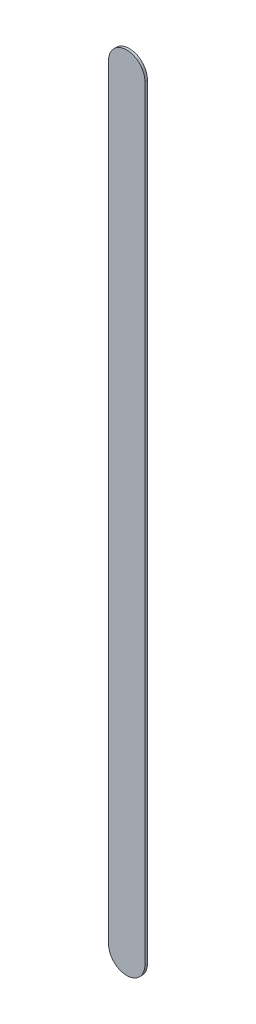
ISO-10303-21;
HEADER;
FILE_DESCRIPTION(('STEP AP214'),'2;1');
FILE_NAME('part.step','',(''),(''),'','','');
FILE_SCHEMA(('AUTOMOTIVE_DESIGN { 1 0 10303 214 1 1 1 1 }'));
ENDSEC;
DATA;
#1=APPLICATION_CONTEXT('core data for automotive mechanical design processes');
#2=APPLICATION_PROTOCOL_DEFINITION('international standard','automotive_design',2000,#1);
#3=PRODUCT_CONTEXT('',#1,'mechanical');
#4=PRODUCT('Part','Part','',(#3));
#5=PRODUCT_RELATED_PRODUCT_CATEGORY('part','',(#4));
#6=PRODUCT_DEFINITION_FORMATION('','',#4);
#7=PRODUCT_DEFINITION_CONTEXT('part definition',#1,'design');
#8=PRODUCT_DEFINITION('design','',#6,#7);
#9=PRODUCT_DEFINITION_SHAPE('','',#8);
#10=(LENGTH_UNIT() NAMED_UNIT(*) SI_UNIT(.MILLI.,.METRE.));
#11=(NAMED_UNIT(*) PLANE_ANGLE_UNIT() SI_UNIT($,.RADIAN.));
#12=(NAMED_UNIT(*) SI_UNIT($,.STERADIAN.) SOLID_ANGLE_UNIT());
#13=UNCERTAINTY_MEASURE_WITH_UNIT(LENGTH_MEASURE(1.E-05),#10,'distance_accuracy_value','');
#14=(GEOMETRIC_REPRESENTATION_CONTEXT(3) GLOBAL_UNCERTAINTY_ASSIGNED_CONTEXT((#13)) GLOBAL_UNIT_ASSIGNED_CONTEXT((#10,
#11,#12)) REPRESENTATION_CONTEXT('',''));
#15=CARTESIAN_POINT('',(0.,0.,0.));
#16=DIRECTION('',(0.,0.,1.));
#17=DIRECTION('',(1.,0.,0.));
#18=AXIS2_PLACEMENT_3D('',#15,#16,#17);
#19=CARTESIAN_POINT('',(119.376,-111.252,0.));
#20=DIRECTION('',(0.,0.,1.));
#21=DIRECTION('',(1.,0.,0.));
#22=AXIS2_PLACEMENT_3D('',#19,#20,#21);
#23=PLANE('',#22);
#24=DIRECTION('',(0.,1.,0.));
#25=VECTOR('',#24,1.);
#26=CARTESIAN_POINT('',(119.376,-111.252,0.));
#27=LINE('',#26,#25);
#28=CARTESIAN_POINT('',(119.376,-111.252,0.));
#29=VERTEX_POINT('',#28);
#30=CARTESIAN_POINT('',(119.376,-100.711,0.));
#31=VERTEX_POINT('',#30);
#32=EDGE_CURVE('E81',#29,#31,#27,.T.);
#33=ORIENTED_EDGE('',*,*,#32,.T.);
#34=CARTESIAN_POINT('',(119.126,-100.711,0.));
#35=DIRECTION('',(0.,0.,1.));
#36=DIRECTION('',(1.,0.,0.));
#37=AXIS2_PLACEMENT_3D('',#34,#35,#36);
#38=CIRCLE('',#37,0.25);
#39=CARTESIAN_POINT('',(118.876,-100.711,0.));
#40=VERTEX_POINT('',#39);
#41=EDGE_CURVE('E101',#31,#40,#38,.T.);
#42=ORIENTED_EDGE('',*,*,#41,.T.);
#43=DIRECTION('',(0.,-1.,0.));
#44=VECTOR('',#43,1.);
#45=CARTESIAN_POINT('',(118.876,-100.711,0.));
#46=LINE('',#45,#44);
#47=CARTESIAN_POINT('',(118.876,-111.252,0.));
#48=VERTEX_POINT('',#47);
#49=EDGE_CURVE('E74',#40,#48,#46,.T.);
#50=ORIENTED_EDGE('',*,*,#49,.T.);
#51=CARTESIAN_POINT('',(119.126,-111.252,0.));
#52=DIRECTION('',(0.,0.,1.));
#53=DIRECTION('',(-1.,0.,0.));
#54=AXIS2_PLACEMENT_3D('',#51,#52,#53);
#55=CIRCLE('',#54,0.25);
#56=EDGE_CURVE('E11',#48,#29,#55,.T.);
#57=ORIENTED_EDGE('',*,*,#56,.T.);
#58=EDGE_LOOP('',(#33,#42,#50,#57));
#59=FACE_BOUND('',#58,.T.);
#60=ADVANCED_FACE('F17',(#59),#23,.T.);
#61=CARTESIAN_POINT('',(119.376,-111.252,-0.035));
#62=DIRECTION('',(0.,0.,1.));
#63=DIRECTION('',(1.,0.,0.));
#64=AXIS2_PLACEMENT_3D('',#61,#62,#63);
#65=PLANE('',#64);
#66=CARTESIAN_POINT('',(119.126,-111.252,-0.035));
#67=DIRECTION('',(0.,0.,1.));
#68=DIRECTION('',(-1.,0.,0.));
#69=AXIS2_PLACEMENT_3D('',#66,#67,#68);
#70=CIRCLE('',#69,0.25);
#71=CARTESIAN_POINT('',(118.876,-111.252,-0.035));
#72=VERTEX_POINT('',#71);
#73=CARTESIAN_POINT('',(119.376,-111.252,-0.035));
#74=VERTEX_POINT('',#73);
#75=EDGE_CURVE('E26',#72,#74,#70,.T.);
#76=ORIENTED_EDGE('',*,*,#75,.F.);
#77=DIRECTION('',(0.,-1.,0.));
#78=VECTOR('',#77,1.);
#79=CARTESIAN_POINT('',(118.876,-100.711,-0.035));
#80=LINE('',#79,#78);
#81=CARTESIAN_POINT('',(118.876,-100.711,-0.035));
#82=VERTEX_POINT('',#81);
#83=EDGE_CURVE('E105',#82,#72,#80,.T.);
#84=ORIENTED_EDGE('',*,*,#83,.F.);
#85=CARTESIAN_POINT('',(119.126,-100.711,-0.035));
#86=DIRECTION('',(0.,0.,1.));
#87=DIRECTION('',(1.,0.,0.));
#88=AXIS2_PLACEMENT_3D('',#85,#86,#87);
#89=CIRCLE('',#88,0.25);
#90=CARTESIAN_POINT('',(119.376,-100.711,-0.035));
#91=VERTEX_POINT('',#90);
#92=EDGE_CURVE('E83',#91,#82,#89,.T.);
#93=ORIENTED_EDGE('',*,*,#92,.F.);
#94=DIRECTION('',(0.,1.,0.));
#95=VECTOR('',#94,1.);
#96=CARTESIAN_POINT('',(119.376,-111.252,-0.035));
#97=LINE('',#96,#95);
#98=EDGE_CURVE('E79',#74,#91,#97,.T.);
#99=ORIENTED_EDGE('',*,*,#98,.F.);
#100=EDGE_LOOP('',(#76,#84,#93,#99));
#101=FACE_BOUND('',#100,.T.);
#102=ADVANCED_FACE('F19',(#101),#65,.F.);
#103=CARTESIAN_POINT('',(119.126,-111.252,-0.035));
#104=DIRECTION('',(0.,0.,-1.));
#105=DIRECTION('',(-1.,0.,0.));
#106=AXIS2_PLACEMENT_3D('',#103,#104,#105);
#107=CYLINDRICAL_SURFACE('',#106,0.25);
#108=ORIENTED_EDGE('',*,*,#75,.T.);
#109=DIRECTION('',(0.,0.,1.));
#110=VECTOR('',#109,1.);
#111=CARTESIAN_POINT('',(119.376,-111.252,-0.035));
#112=LINE('',#111,#110);
#113=EDGE_CURVE('E68',#74,#29,#112,.T.);
#114=ORIENTED_EDGE('',*,*,#113,.T.);
#115=ORIENTED_EDGE('',*,*,#56,.F.);
#116=DIRECTION('',(0.,0.,1.));
#117=VECTOR('',#116,1.);
#118=CARTESIAN_POINT('',(118.876,-111.252,-0.035));
#119=LINE('',#118,#117);
#120=EDGE_CURVE('E71',#72,#48,#119,.T.);
#121=ORIENTED_EDGE('',*,*,#120,.F.);
#122=EDGE_LOOP('',(#108,#114,#115,#121));
#123=FACE_BOUND('',#122,.T.);
#124=ADVANCED_FACE('F67',(#123),#107,.T.);
#125=CARTESIAN_POINT('',(118.876,-100.711,-0.035));
#126=DIRECTION('',(1.,0.,0.));
#127=DIRECTION('',(0.,1.,0.));
#128=AXIS2_PLACEMENT_3D('',#125,#126,#127);
#129=PLANE('',#128);
#130=ORIENTED_EDGE('',*,*,#83,.T.);
#131=ORIENTED_EDGE('',*,*,#120,.T.);
#132=ORIENTED_EDGE('',*,*,#49,.F.);
#133=DIRECTION('',(0.,0.,1.));
#134=VECTOR('',#133,1.);
#135=CARTESIAN_POINT('',(118.876,-100.711,-0.035));
#136=LINE('',#135,#134);
#137=EDGE_CURVE('E100',#82,#40,#136,.T.);
#138=ORIENTED_EDGE('',*,*,#137,.F.);
#139=EDGE_LOOP('',(#130,#131,#132,#138));
#140=FACE_BOUND('',#139,.T.);
#141=ADVANCED_FACE('F119',(#140),#129,.F.);
#142=CARTESIAN_POINT('',(119.126,-100.711,-0.035));
#143=DIRECTION('',(0.,0.,-1.));
#144=DIRECTION('',(1.,0.,0.));
#145=AXIS2_PLACEMENT_3D('',#142,#143,#144);
#146=CYLINDRICAL_SURFACE('',#145,0.25);
#147=ORIENTED_EDGE('',*,*,#92,.T.);
#148=ORIENTED_EDGE('',*,*,#137,.T.);
#149=ORIENTED_EDGE('',*,*,#41,.F.);
#150=DIRECTION('',(0.,0.,1.));
#151=VECTOR('',#150,1.);
#152=CARTESIAN_POINT('',(119.376,-100.711,-0.035));
#153=LINE('',#152,#151);
#154=EDGE_CURVE('E88',#91,#31,#153,.T.);
#155=ORIENTED_EDGE('',*,*,#154,.F.);
#156=EDGE_LOOP('',(#147,#148,#149,#155));
#157=FACE_BOUND('',#156,.T.);
#158=ADVANCED_FACE('F121',(#157),#146,.T.);
#159=CARTESIAN_POINT('',(119.376,-111.252,-0.035));
#160=DIRECTION('',(-1.,0.,0.));
#161=DIRECTION('',(0.,0.,1.));
#162=AXIS2_PLACEMENT_3D('',#159,#160,#161);
#163=PLANE('',#162);
#164=ORIENTED_EDGE('',*,*,#98,.T.);
#165=ORIENTED_EDGE('',*,*,#154,.T.);
#166=ORIENTED_EDGE('',*,*,#32,.F.);
#167=ORIENTED_EDGE('',*,*,#113,.F.);
#168=EDGE_LOOP('',(#164,#165,#166,#167));
#169=FACE_BOUND('',#168,.T.);
#170=ADVANCED_FACE('F77',(#169),#163,.F.);
#171=CLOSED_SHELL('',(#60,#102,#124,#141,#158,#170));
#172=MANIFOLD_SOLID_BREP('B1',#171);
#173=ADVANCED_BREP_SHAPE_REPRESENTATION('',(#18,#172),#14);
#174=SHAPE_DEFINITION_REPRESENTATION(#9,#173);
ENDSEC;
END-ISO-10303-21;
